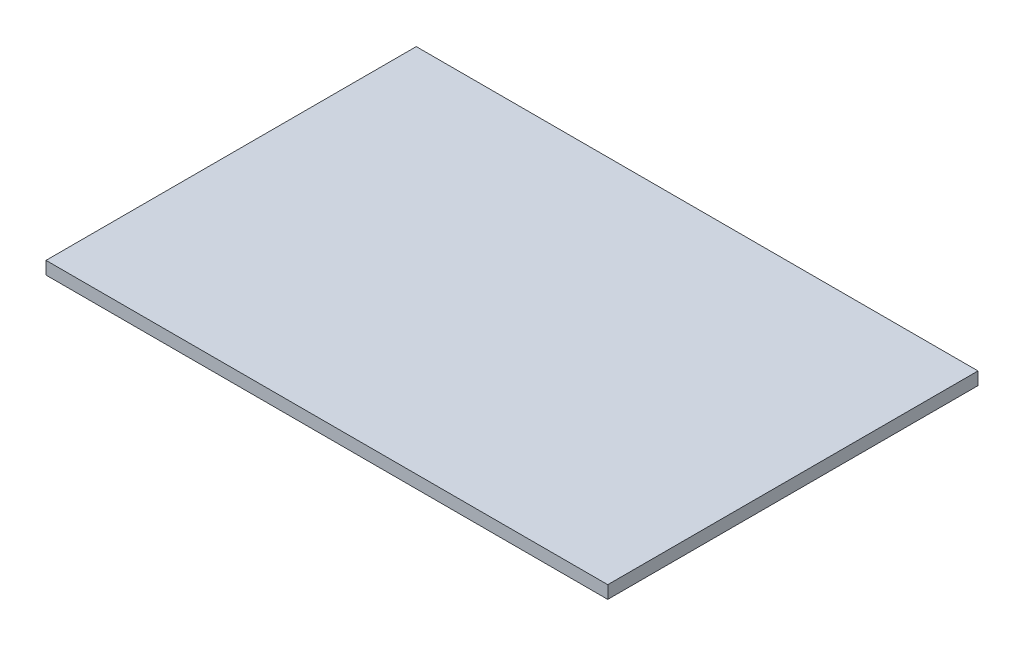
ISO-10303-21;
HEADER;
FILE_DESCRIPTION(('STEP AP214'),'2;1');
FILE_NAME('part.step','',(''),(''),'','','');
FILE_SCHEMA(('AUTOMOTIVE_DESIGN { 1 0 10303 214 1 1 1 1 }'));
ENDSEC;
DATA;
#1=APPLICATION_CONTEXT('core data for automotive mechanical design processes');
#2=APPLICATION_PROTOCOL_DEFINITION('international standard','automotive_design',2000,#1);
#3=PRODUCT_CONTEXT('',#1,'mechanical');
#4=PRODUCT('Part','Part','',(#3));
#5=PRODUCT_RELATED_PRODUCT_CATEGORY('part','',(#4));
#6=PRODUCT_DEFINITION_FORMATION('','',#4);
#7=PRODUCT_DEFINITION_CONTEXT('part definition',#1,'design');
#8=PRODUCT_DEFINITION('design','',#6,#7);
#9=PRODUCT_DEFINITION_SHAPE('','',#8);
#10=(LENGTH_UNIT() NAMED_UNIT(*) SI_UNIT(.MILLI.,.METRE.));
#11=(NAMED_UNIT(*) PLANE_ANGLE_UNIT() SI_UNIT($,.RADIAN.));
#12=(NAMED_UNIT(*) SI_UNIT($,.STERADIAN.) SOLID_ANGLE_UNIT());
#13=UNCERTAINTY_MEASURE_WITH_UNIT(LENGTH_MEASURE(1.E-05),#10,'distance_accuracy_value','');
#14=(GEOMETRIC_REPRESENTATION_CONTEXT(3) GLOBAL_UNCERTAINTY_ASSIGNED_CONTEXT((#13)) GLOBAL_UNIT_ASSIGNED_CONTEXT((#10,
#11,#12)) REPRESENTATION_CONTEXT('',''));
#15=CARTESIAN_POINT('',(0.,0.,0.));
#16=DIRECTION('',(0.,0.,1.));
#17=DIRECTION('',(1.,0.,0.));
#18=AXIS2_PLACEMENT_3D('',#15,#16,#17);
#19=CARTESIAN_POINT('',(0.,5.,0.));
#20=DIRECTION('',(1.,0.,0.));
#21=DIRECTION('',(0.,0.,-1.));
#22=AXIS2_PLACEMENT_3D('',#19,#20,#21);
#23=PLANE('',#22);
#24=DIRECTION('',(0.,0.,1.));
#25=VECTOR('',#24,1.);
#26=CARTESIAN_POINT('',(0.,0.,0.));
#27=LINE('',#26,#25);
#28=CARTESIAN_POINT('',(0.,0.,-145.));
#29=VERTEX_POINT('',#28);
#30=CARTESIAN_POINT('',(0.,0.,0.));
#31=VERTEX_POINT('',#30);
#32=EDGE_CURVE('E109',#29,#31,#27,.T.);
#33=ORIENTED_EDGE('',*,*,#32,.T.);
#34=DIRECTION('',(0.,-1.,0.));
#35=VECTOR('',#34,1.);
#36=CARTESIAN_POINT('',(0.,5.,0.));
#37=LINE('',#36,#35);
#38=CARTESIAN_POINT('',(0.,5.,0.));
#39=VERTEX_POINT('',#38);
#40=EDGE_CURVE('E11',#39,#31,#37,.T.);
#41=ORIENTED_EDGE('',*,*,#40,.F.);
#42=DIRECTION('',(0.,0.,1.));
#43=VECTOR('',#42,1.);
#44=CARTESIAN_POINT('',(0.,5.,0.));
#45=LINE('',#44,#43);
#46=CARTESIAN_POINT('',(0.,5.,-145.));
#47=VERTEX_POINT('',#46);
#48=EDGE_CURVE('E93',#47,#39,#45,.T.);
#49=ORIENTED_EDGE('',*,*,#48,.F.);
#50=DIRECTION('',(0.,-1.,0.));
#51=VECTOR('',#50,1.);
#52=CARTESIAN_POINT('',(0.,5.,-145.));
#53=LINE('',#52,#51);
#54=EDGE_CURVE('E105',#47,#29,#53,.T.);
#55=ORIENTED_EDGE('',*,*,#54,.T.);
#56=EDGE_LOOP('',(#33,#41,#49,#55));
#57=FACE_BOUND('',#56,.T.);
#58=ADVANCED_FACE('F41',(#57),#23,.F.);
#59=CARTESIAN_POINT('',(0.,5.,0.));
#60=DIRECTION('',(0.,0.,-1.));
#61=DIRECTION('',(-1.,0.,0.));
#62=AXIS2_PLACEMENT_3D('',#59,#60,#61);
#63=PLANE('',#62);
#64=DIRECTION('',(1.,0.,0.));
#65=VECTOR('',#64,1.);
#66=CARTESIAN_POINT('',(0.,0.,0.));
#67=LINE('',#66,#65);
#68=CARTESIAN_POINT('',(220.,0.,0.));
#69=VERTEX_POINT('',#68);
#70=EDGE_CURVE('E98',#31,#69,#67,.T.);
#71=ORIENTED_EDGE('',*,*,#70,.T.);
#72=DIRECTION('',(0.,-1.,0.));
#73=VECTOR('',#72,1.);
#74=CARTESIAN_POINT('',(220.,5.,0.));
#75=LINE('',#74,#73);
#76=CARTESIAN_POINT('',(220.,5.,0.));
#77=VERTEX_POINT('',#76);
#78=EDGE_CURVE('E50',#77,#69,#75,.T.);
#79=ORIENTED_EDGE('',*,*,#78,.F.);
#80=DIRECTION('',(1.,0.,0.));
#81=VECTOR('',#80,1.);
#82=CARTESIAN_POINT('',(0.,5.,0.));
#83=LINE('',#82,#81);
#84=EDGE_CURVE('E88',#39,#77,#83,.T.);
#85=ORIENTED_EDGE('',*,*,#84,.F.);
#86=ORIENTED_EDGE('',*,*,#40,.T.);
#87=EDGE_LOOP('',(#71,#79,#85,#86));
#88=FACE_BOUND('',#87,.T.);
#89=ADVANCED_FACE('F97',(#88),#63,.F.);
#90=CARTESIAN_POINT('',(220.,5.,0.));
#91=DIRECTION('',(-1.,0.,0.));
#92=DIRECTION('',(0.,0.,1.));
#93=AXIS2_PLACEMENT_3D('',#90,#91,#92);
#94=PLANE('',#93);
#95=DIRECTION('',(0.,0.,-1.));
#96=VECTOR('',#95,1.);
#97=CARTESIAN_POINT('',(220.,0.,0.));
#98=LINE('',#97,#96);
#99=CARTESIAN_POINT('',(220.,0.,-145.));
#100=VERTEX_POINT('',#99);
#101=EDGE_CURVE('E75',#69,#100,#98,.T.);
#102=ORIENTED_EDGE('',*,*,#101,.T.);
#103=DIRECTION('',(0.,-1.,0.));
#104=VECTOR('',#103,1.);
#105=CARTESIAN_POINT('',(220.,5.,-145.));
#106=LINE('',#105,#104);
#107=CARTESIAN_POINT('',(220.,5.,-145.));
#108=VERTEX_POINT('',#107);
#109=EDGE_CURVE('E100',#108,#100,#106,.T.);
#110=ORIENTED_EDGE('',*,*,#109,.F.);
#111=DIRECTION('',(0.,0.,-1.));
#112=VECTOR('',#111,1.);
#113=CARTESIAN_POINT('',(220.,5.,0.));
#114=LINE('',#113,#112);
#115=EDGE_CURVE('E91',#77,#108,#114,.T.);
#116=ORIENTED_EDGE('',*,*,#115,.F.);
#117=ORIENTED_EDGE('',*,*,#78,.T.);
#118=EDGE_LOOP('',(#102,#110,#116,#117));
#119=FACE_BOUND('',#118,.T.);
#120=ADVANCED_FACE('F101',(#119),#94,.F.);
#121=CARTESIAN_POINT('',(0.,5.,-145.));
#122=DIRECTION('',(0.,0.,1.));
#123=DIRECTION('',(1.,0.,0.));
#124=AXIS2_PLACEMENT_3D('',#121,#122,#123);
#125=PLANE('',#124);
#126=DIRECTION('',(-1.,0.,0.));
#127=VECTOR('',#126,1.);
#128=CARTESIAN_POINT('',(0.,0.,-145.));
#129=LINE('',#128,#127);
#130=EDGE_CURVE('E81',#100,#29,#129,.T.);
#131=ORIENTED_EDGE('',*,*,#130,.T.);
#132=ORIENTED_EDGE('',*,*,#54,.F.);
#133=DIRECTION('',(-1.,0.,0.));
#134=VECTOR('',#133,1.);
#135=CARTESIAN_POINT('',(0.,5.,-145.));
#136=LINE('',#135,#134);
#137=EDGE_CURVE('E58',#108,#47,#136,.T.);
#138=ORIENTED_EDGE('',*,*,#137,.F.);
#139=ORIENTED_EDGE('',*,*,#109,.T.);
#140=EDGE_LOOP('',(#131,#132,#138,#139));
#141=FACE_BOUND('',#140,.T.);
#142=ADVANCED_FACE('F122',(#141),#125,.F.);
#143=CARTESIAN_POINT('',(0.,5.,0.));
#144=DIRECTION('',(0.,-1.,0.));
#145=DIRECTION('',(0.,0.,-1.));
#146=AXIS2_PLACEMENT_3D('',#143,#144,#145);
#147=PLANE('',#146);
#148=ORIENTED_EDGE('',*,*,#48,.T.);
#149=ORIENTED_EDGE('',*,*,#84,.T.);
#150=ORIENTED_EDGE('',*,*,#115,.T.);
#151=ORIENTED_EDGE('',*,*,#137,.T.);
#152=EDGE_LOOP('',(#148,#149,#150,#151));
#153=FACE_BOUND('',#152,.T.);
#154=ADVANCED_FACE('F89',(#153),#147,.F.);
#155=CARTESIAN_POINT('',(0.,0.,0.));
#156=DIRECTION('',(0.,-1.,0.));
#157=DIRECTION('',(0.,0.,-1.));
#158=AXIS2_PLACEMENT_3D('',#155,#156,#157);
#159=PLANE('',#158);
#160=ORIENTED_EDGE('',*,*,#32,.F.);
#161=ORIENTED_EDGE('',*,*,#130,.F.);
#162=ORIENTED_EDGE('',*,*,#101,.F.);
#163=ORIENTED_EDGE('',*,*,#70,.F.);
#164=EDGE_LOOP('',(#160,#161,#162,#163));
#165=FACE_BOUND('',#164,.T.);
#166=ADVANCED_FACE('F125',(#165),#159,.T.);
#167=CLOSED_SHELL('',(#58,#89,#120,#142,#154,#166));
#168=MANIFOLD_SOLID_BREP('B2',#167);
#169=ADVANCED_BREP_SHAPE_REPRESENTATION('',(#18,#168),#14);
#170=SHAPE_DEFINITION_REPRESENTATION(#9,#169);
ENDSEC;
END-ISO-10303-21;
